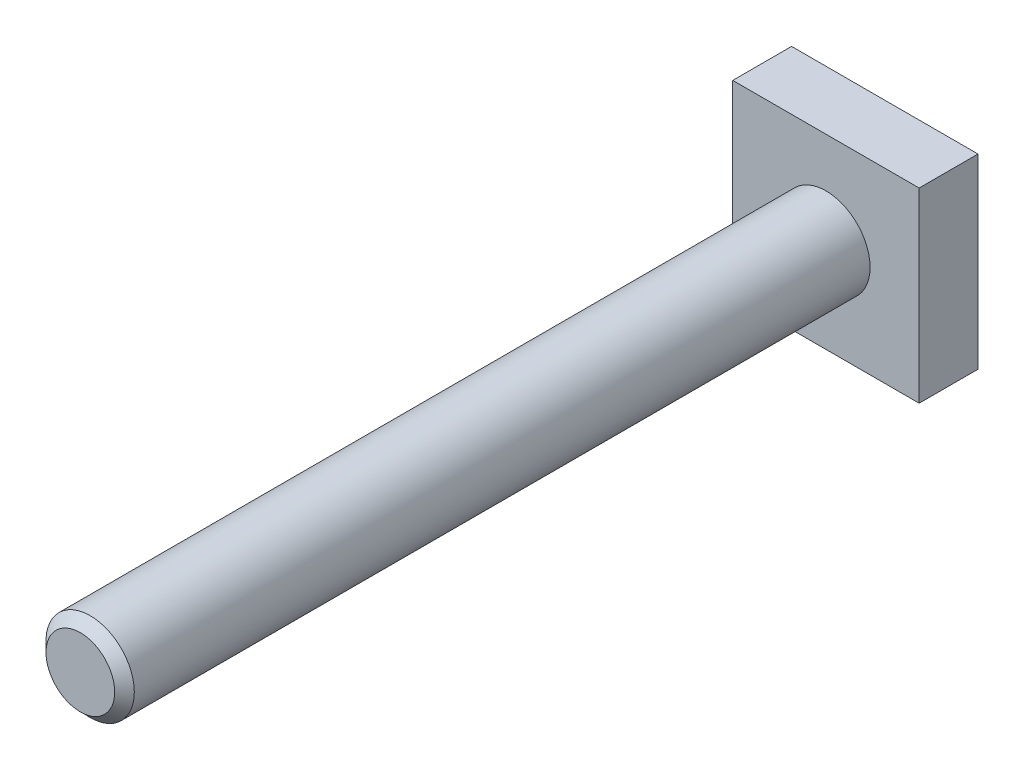
ISO-10303-21;
HEADER;
FILE_DESCRIPTION(('STEP AP214'),'2;1');
FILE_NAME('part.step','',(''),(''),'','','');
FILE_SCHEMA(('AUTOMOTIVE_DESIGN { 1 0 10303 214 1 1 1 1 }'));
ENDSEC;
DATA;
#1=APPLICATION_CONTEXT('core data for automotive mechanical design processes');
#2=APPLICATION_PROTOCOL_DEFINITION('international standard','automotive_design',2000,#1);
#3=PRODUCT_CONTEXT('',#1,'mechanical');
#4=PRODUCT('Part','Part','',(#3));
#5=PRODUCT_RELATED_PRODUCT_CATEGORY('part','',(#4));
#6=PRODUCT_DEFINITION_FORMATION('','',#4);
#7=PRODUCT_DEFINITION_CONTEXT('part definition',#1,'design');
#8=PRODUCT_DEFINITION('design','',#6,#7);
#9=PRODUCT_DEFINITION_SHAPE('','',#8);
#10=(LENGTH_UNIT() NAMED_UNIT(*) SI_UNIT(.MILLI.,.METRE.));
#11=(NAMED_UNIT(*) PLANE_ANGLE_UNIT() SI_UNIT($,.RADIAN.));
#12=(NAMED_UNIT(*) SI_UNIT($,.STERADIAN.) SOLID_ANGLE_UNIT());
#13=UNCERTAINTY_MEASURE_WITH_UNIT(LENGTH_MEASURE(1.E-05),#10,'distance_accuracy_value','');
#14=(GEOMETRIC_REPRESENTATION_CONTEXT(3) GLOBAL_UNCERTAINTY_ASSIGNED_CONTEXT((#13)) GLOBAL_UNIT_ASSIGNED_CONTEXT((#10,
#11,#12)) REPRESENTATION_CONTEXT('',''));
#15=CARTESIAN_POINT('',(0.,0.,0.));
#16=DIRECTION('',(0.,0.,1.));
#17=DIRECTION('',(1.,0.,0.));
#18=AXIS2_PLACEMENT_3D('',#15,#16,#17);
#19=CARTESIAN_POINT('',(9.5,9.5,3.));
#20=DIRECTION('',(-1.,0.,0.));
#21=DIRECTION('',(0.,-1.,0.));
#22=AXIS2_PLACEMENT_3D('',#19,#20,#21);
#23=PLANE('',#22);
#24=DIRECTION('',(0.,1.,0.));
#25=VECTOR('',#24,1.);
#26=CARTESIAN_POINT('',(9.5,9.5,-3.));
#27=LINE('',#26,#25);
#28=CARTESIAN_POINT('',(9.5,-9.5,-3.));
#29=VERTEX_POINT('',#28);
#30=CARTESIAN_POINT('',(9.5,9.5,-3.));
#31=VERTEX_POINT('',#30);
#32=EDGE_CURVE('E101',#29,#31,#27,.T.);
#33=ORIENTED_EDGE('',*,*,#32,.T.);
#34=DIRECTION('',(0.,0.,-1.));
#35=VECTOR('',#34,1.);
#36=CARTESIAN_POINT('',(9.5,9.5,3.));
#37=LINE('',#36,#35);
#38=CARTESIAN_POINT('',(9.5,9.5,3.));
#39=VERTEX_POINT('',#38);
#40=EDGE_CURVE('E92',#39,#31,#37,.T.);
#41=ORIENTED_EDGE('',*,*,#40,.F.);
#42=DIRECTION('',(0.,1.,0.));
#43=VECTOR('',#42,1.);
#44=CARTESIAN_POINT('',(9.5,9.5,3.));
#45=LINE('',#44,#43);
#46=CARTESIAN_POINT('',(9.5,-9.5,3.));
#47=VERTEX_POINT('',#46);
#48=EDGE_CURVE('E86',#47,#39,#45,.T.);
#49=ORIENTED_EDGE('',*,*,#48,.F.);
#50=DIRECTION('',(0.,0.,-1.));
#51=VECTOR('',#50,1.);
#52=CARTESIAN_POINT('',(9.5,-9.5,3.));
#53=LINE('',#52,#51);
#54=EDGE_CURVE('E97',#47,#29,#53,.T.);
#55=ORIENTED_EDGE('',*,*,#54,.T.);
#56=EDGE_LOOP('',(#33,#41,#49,#55));
#57=FACE_BOUND('',#56,.T.);
#58=ADVANCED_FACE('F33',(#57),#23,.F.);
#59=CARTESIAN_POINT('',(-9.5,9.5,3.));
#60=DIRECTION('',(0.,-1.,0.));
#61=DIRECTION('',(0.,0.,-1.));
#62=AXIS2_PLACEMENT_3D('',#59,#60,#61);
#63=PLANE('',#62);
#64=DIRECTION('',(-1.,0.,0.));
#65=VECTOR('',#64,1.);
#66=CARTESIAN_POINT('',(-9.5,9.5,-3.));
#67=LINE('',#66,#65);
#68=CARTESIAN_POINT('',(-9.5,9.5,-3.));
#69=VERTEX_POINT('',#68);
#70=EDGE_CURVE('E91',#31,#69,#67,.T.);
#71=ORIENTED_EDGE('',*,*,#70,.T.);
#72=DIRECTION('',(0.,0.,-1.));
#73=VECTOR('',#72,1.);
#74=CARTESIAN_POINT('',(-9.5,9.5,3.));
#75=LINE('',#74,#73);
#76=CARTESIAN_POINT('',(-9.5,9.5,3.));
#77=VERTEX_POINT('',#76);
#78=EDGE_CURVE('E89',#77,#69,#75,.T.);
#79=ORIENTED_EDGE('',*,*,#78,.F.);
#80=DIRECTION('',(-1.,0.,0.));
#81=VECTOR('',#80,1.);
#82=CARTESIAN_POINT('',(-9.5,9.5,3.));
#83=LINE('',#82,#81);
#84=EDGE_CURVE('E81',#39,#77,#83,.T.);
#85=ORIENTED_EDGE('',*,*,#84,.F.);
#86=ORIENTED_EDGE('',*,*,#40,.T.);
#87=EDGE_LOOP('',(#71,#79,#85,#86));
#88=FACE_BOUND('',#87,.T.);
#89=ADVANCED_FACE('F90',(#88),#63,.F.);
#90=CARTESIAN_POINT('',(-9.5,9.5,3.));
#91=DIRECTION('',(1.,0.,0.));
#92=DIRECTION('',(0.,1.,0.));
#93=AXIS2_PLACEMENT_3D('',#90,#91,#92);
#94=PLANE('',#93);
#95=DIRECTION('',(0.,-1.,0.));
#96=VECTOR('',#95,1.);
#97=CARTESIAN_POINT('',(-9.5,9.5,-3.));
#98=LINE('',#97,#96);
#99=CARTESIAN_POINT('',(-9.5,-9.5,-3.));
#100=VERTEX_POINT('',#99);
#101=EDGE_CURVE('E67',#69,#100,#98,.T.);
#102=ORIENTED_EDGE('',*,*,#101,.T.);
#103=DIRECTION('',(0.,0.,-1.));
#104=VECTOR('',#103,1.);
#105=CARTESIAN_POINT('',(-9.5,-9.5,3.));
#106=LINE('',#105,#104);
#107=CARTESIAN_POINT('',(-9.5,-9.5,3.));
#108=VERTEX_POINT('',#107);
#109=EDGE_CURVE('E93',#108,#100,#106,.T.);
#110=ORIENTED_EDGE('',*,*,#109,.F.);
#111=DIRECTION('',(0.,-1.,0.));
#112=VECTOR('',#111,1.);
#113=CARTESIAN_POINT('',(-9.5,9.5,3.));
#114=LINE('',#113,#112);
#115=EDGE_CURVE('E84',#77,#108,#114,.T.);
#116=ORIENTED_EDGE('',*,*,#115,.F.);
#117=ORIENTED_EDGE('',*,*,#78,.T.);
#118=EDGE_LOOP('',(#102,#110,#116,#117));
#119=FACE_BOUND('',#118,.T.);
#120=ADVANCED_FACE('F95',(#119),#94,.F.);
#121=CARTESIAN_POINT('',(-9.5,-9.5,3.));
#122=DIRECTION('',(0.,1.,0.));
#123=DIRECTION('',(-1.,0.,0.));
#124=AXIS2_PLACEMENT_3D('',#121,#122,#123);
#125=PLANE('',#124);
#126=DIRECTION('',(1.,0.,0.));
#127=VECTOR('',#126,1.);
#128=CARTESIAN_POINT('',(-9.5,-9.5,-3.));
#129=LINE('',#128,#127);
#130=EDGE_CURVE('E73',#100,#29,#129,.T.);
#131=ORIENTED_EDGE('',*,*,#130,.T.);
#132=ORIENTED_EDGE('',*,*,#54,.F.);
#133=DIRECTION('',(1.,0.,0.));
#134=VECTOR('',#133,1.);
#135=CARTESIAN_POINT('',(-9.5,-9.5,3.));
#136=LINE('',#135,#134);
#137=EDGE_CURVE('E50',#108,#47,#136,.T.);
#138=ORIENTED_EDGE('',*,*,#137,.F.);
#139=ORIENTED_EDGE('',*,*,#109,.T.);
#140=EDGE_LOOP('',(#131,#132,#138,#139));
#141=FACE_BOUND('',#140,.T.);
#142=ADVANCED_FACE('F133',(#141),#125,.F.);
#143=CARTESIAN_POINT('',(0.,0.,3.));
#144=DIRECTION('',(0.,0.,1.));
#145=DIRECTION('',(1.,0.,0.));
#146=AXIS2_PLACEMENT_3D('',#143,#144,#145);
#147=PLANE('',#146);
#148=CARTESIAN_POINT('',(0.,0.,3.));
#149=DIRECTION('',(0.,0.,1.));
#150=DIRECTION('',(1.,0.,0.));
#151=AXIS2_PLACEMENT_3D('',#148,#149,#150);
#152=CIRCLE('',#151,4.5);
#153=CARTESIAN_POINT('',(4.5,0.,3.));
#154=VERTEX_POINT('',#153);
#155=EDGE_CURVE('E104',#154,#154,#152,.T.);
#156=ORIENTED_EDGE('',*,*,#155,.F.);
#157=EDGE_LOOP('',(#156));
#158=FACE_BOUND('',#157,.T.);
#159=ORIENTED_EDGE('',*,*,#48,.T.);
#160=ORIENTED_EDGE('',*,*,#84,.T.);
#161=ORIENTED_EDGE('',*,*,#115,.T.);
#162=ORIENTED_EDGE('',*,*,#137,.T.);
#163=EDGE_LOOP('',(#159,#160,#161,#162));
#164=FACE_BOUND('',#163,.T.);
#165=ADVANCED_FACE('F82',(#158,#164),#147,.T.);
#166=CARTESIAN_POINT('',(0.,0.,-3.));
#167=DIRECTION('',(0.,0.,1.));
#168=DIRECTION('',(1.,0.,0.));
#169=AXIS2_PLACEMENT_3D('',#166,#167,#168);
#170=PLANE('',#169);
#171=ORIENTED_EDGE('',*,*,#32,.F.);
#172=ORIENTED_EDGE('',*,*,#130,.F.);
#173=ORIENTED_EDGE('',*,*,#101,.F.);
#174=ORIENTED_EDGE('',*,*,#70,.F.);
#175=EDGE_LOOP('',(#171,#172,#173,#174));
#176=FACE_BOUND('',#175,.T.);
#177=ADVANCED_FACE('F136',(#176),#170,.F.);
#178=CARTESIAN_POINT('',(0.,0.,79.));
#179=DIRECTION('',(0.,0.,-1.));
#180=DIRECTION('',(-1.,0.,0.));
#181=AXIS2_PLACEMENT_3D('',#178,#179,#180);
#182=CYLINDRICAL_SURFACE('',#181,4.5);
#183=CARTESIAN_POINT('',(0.,0.,78.));
#184=DIRECTION('',(0.,0.,1.));
#185=DIRECTION('',(1.,0.,0.));
#186=AXIS2_PLACEMENT_3D('',#183,#184,#185);
#187=CIRCLE('',#186,4.5);
#188=CARTESIAN_POINT('',(4.5,0.,78.));
#189=VERTEX_POINT('',#188);
#190=EDGE_CURVE('E11',#189,#189,#187,.F.);
#191=ORIENTED_EDGE('',*,*,#190,.T.);
#192=EDGE_LOOP('',(#191));
#193=FACE_BOUND('',#192,.T.);
#194=ORIENTED_EDGE('',*,*,#155,.T.);
#195=EDGE_LOOP('',(#194));
#196=FACE_BOUND('',#195,.T.);
#197=ADVANCED_FACE('F121',(#193,#196),#182,.T.);
#198=CARTESIAN_POINT('',(0.,0.,79.));
#199=DIRECTION('',(0.,0.,1.));
#200=DIRECTION('',(1.,0.,0.));
#201=AXIS2_PLACEMENT_3D('',#198,#199,#200);
#202=PLANE('',#201);
#203=CARTESIAN_POINT('',(0.,0.,79.));
#204=DIRECTION('',(0.,0.,1.));
#205=DIRECTION('',(1.,0.,0.));
#206=AXIS2_PLACEMENT_3D('',#203,#204,#205);
#207=CIRCLE('',#206,3.50000000000002);
#208=CARTESIAN_POINT('',(3.50000000000002,0.,79.));
#209=VERTEX_POINT('',#208);
#210=EDGE_CURVE('E42',#209,#209,#207,.T.);
#211=ORIENTED_EDGE('',*,*,#210,.T.);
#212=EDGE_LOOP('',(#211));
#213=FACE_BOUND('',#212,.T.);
#214=ADVANCED_FACE('F113',(#213),#202,.T.);
#215=CARTESIAN_POINT('',(0.,0.,79.));
#216=DIRECTION('',(0.,0.,-1.));
#217=DIRECTION('',(-1.,0.,0.));
#218=AXIS2_PLACEMENT_3D('',#215,#216,#217);
#219=CONICAL_SURFACE('',#218,3.50000000000002,0.785398163397439);
#220=ORIENTED_EDGE('',*,*,#190,.F.);
#221=EDGE_LOOP('',(#220));
#222=FACE_BOUND('',#221,.T.);
#223=ORIENTED_EDGE('',*,*,#210,.F.);
#224=EDGE_LOOP('',(#223));
#225=FACE_BOUND('',#224,.T.);
#226=ADVANCED_FACE('F35',(#222,#225),#219,.T.);
#227=CLOSED_SHELL('',(#58,#89,#120,#142,#165,#177,#197,#214,#226));
#228=MANIFOLD_SOLID_BREP('B2',#227);
#229=ADVANCED_BREP_SHAPE_REPRESENTATION('',(#18,#228),#14);
#230=SHAPE_DEFINITION_REPRESENTATION(#9,#229);
ENDSEC;
END-ISO-10303-21;
